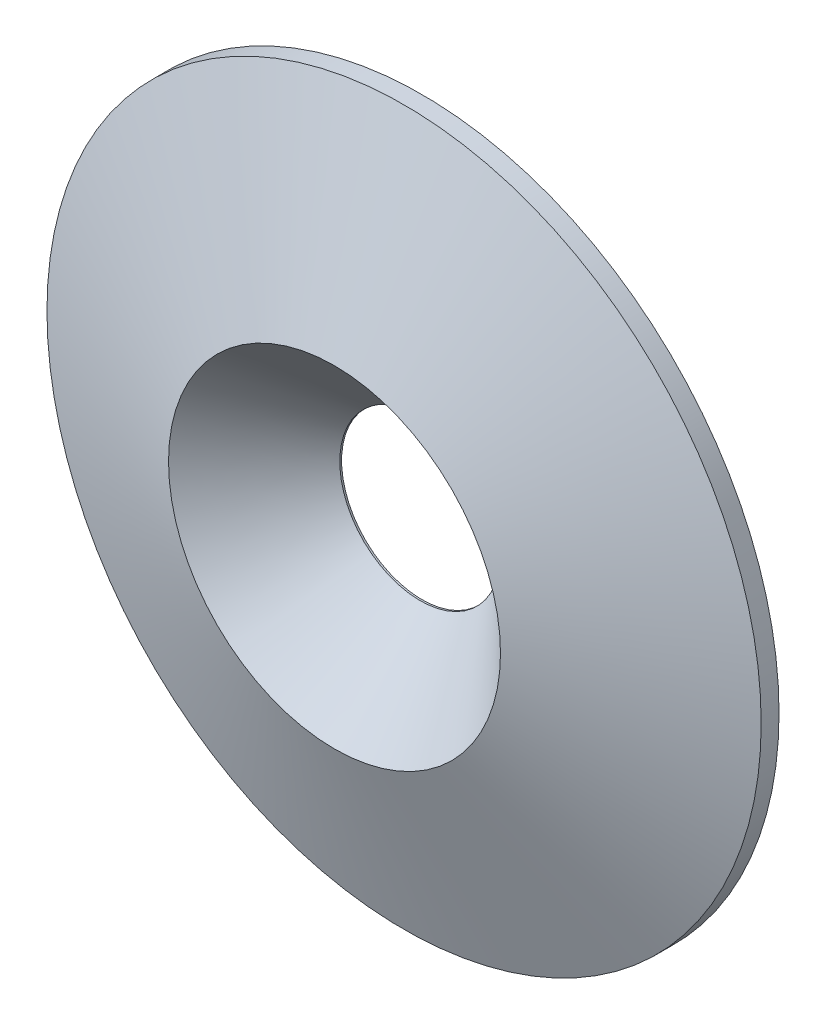
ISO-10303-21;
HEADER;
FILE_DESCRIPTION(('STEP AP214'),'2;1');
FILE_NAME('part.step','',(''),(''),'','','');
FILE_SCHEMA(('AUTOMOTIVE_DESIGN { 1 0 10303 214 1 1 1 1 }'));
ENDSEC;
DATA;
#1=APPLICATION_CONTEXT('core data for automotive mechanical design processes');
#2=APPLICATION_PROTOCOL_DEFINITION('international standard','automotive_design',2000,#1);
#3=PRODUCT_CONTEXT('',#1,'mechanical');
#4=PRODUCT('Part','Part','',(#3));
#5=PRODUCT_RELATED_PRODUCT_CATEGORY('part','',(#4));
#6=PRODUCT_DEFINITION_FORMATION('','',#4);
#7=PRODUCT_DEFINITION_CONTEXT('part definition',#1,'design');
#8=PRODUCT_DEFINITION('design','',#6,#7);
#9=PRODUCT_DEFINITION_SHAPE('','',#8);
#10=(LENGTH_UNIT() NAMED_UNIT(*) SI_UNIT(.MILLI.,.METRE.));
#11=(NAMED_UNIT(*) PLANE_ANGLE_UNIT() SI_UNIT($,.RADIAN.));
#12=(NAMED_UNIT(*) SI_UNIT($,.STERADIAN.) SOLID_ANGLE_UNIT());
#13=UNCERTAINTY_MEASURE_WITH_UNIT(LENGTH_MEASURE(1.E-05),#10,'distance_accuracy_value','');
#14=(GEOMETRIC_REPRESENTATION_CONTEXT(3) GLOBAL_UNCERTAINTY_ASSIGNED_CONTEXT((#13)) GLOBAL_UNIT_ASSIGNED_CONTEXT((#10,
#11,#12)) REPRESENTATION_CONTEXT('',''));
#15=CARTESIAN_POINT('',(0.,0.,0.));
#16=DIRECTION('',(0.,0.,1.));
#17=DIRECTION('',(1.,0.,0.));
#18=AXIS2_PLACEMENT_3D('',#15,#16,#17);
#19=CARTESIAN_POINT('',(0.,0.,2.5));
#20=DIRECTION('',(0.,0.,-1.));
#21=DIRECTION('',(-1.,0.,0.));
#22=AXIS2_PLACEMENT_3D('',#19,#20,#21);
#23=CYLINDRICAL_SURFACE('',#22,10.);
#24=CARTESIAN_POINT('',(0.,0.,0.499999999999961));
#25=DIRECTION('',(0.,0.,1.));
#26=DIRECTION('',(1.,0.,0.));
#27=AXIS2_PLACEMENT_3D('',#24,#25,#26);
#28=CIRCLE('',#27,10.);
#29=CARTESIAN_POINT('',(10.,0.,0.499999999999961));
#30=VERTEX_POINT('',#29);
#31=EDGE_CURVE('E10',#30,#30,#28,.F.);
#32=ORIENTED_EDGE('',*,*,#31,.T.);
#33=EDGE_LOOP('',(#32));
#34=FACE_BOUND('',#33,.T.);
#35=CARTESIAN_POINT('',(0.,0.,0.));
#36=DIRECTION('',(0.,0.,1.));
#37=DIRECTION('',(1.,0.,0.));
#38=AXIS2_PLACEMENT_3D('',#35,#36,#37);
#39=CIRCLE('',#38,10.);
#40=CARTESIAN_POINT('',(10.,0.,0.));
#41=VERTEX_POINT('',#40);
#42=EDGE_CURVE('E45',#41,#41,#39,.T.);
#43=ORIENTED_EDGE('',*,*,#42,.T.);
#44=EDGE_LOOP('',(#43));
#45=FACE_BOUND('',#44,.T.);
#46=ADVANCED_FACE('F34',(#34,#45),#23,.T.);
#47=CARTESIAN_POINT('',(0.,0.,0.));
#48=DIRECTION('',(0.,0.,1.));
#49=DIRECTION('',(1.,0.,0.));
#50=AXIS2_PLACEMENT_3D('',#47,#48,#49);
#51=PLANE('',#50);
#52=CARTESIAN_POINT('',(0.,0.,0.));
#53=DIRECTION('',(0.,0.,1.));
#54=DIRECTION('',(1.,0.,0.));
#55=AXIS2_PLACEMENT_3D('',#52,#53,#54);
#56=CIRCLE('',#55,2.25);
#57=CARTESIAN_POINT('',(2.25,0.,0.));
#58=VERTEX_POINT('',#57);
#59=EDGE_CURVE('E49',#58,#58,#56,.T.);
#60=ORIENTED_EDGE('',*,*,#59,.T.);
#61=EDGE_LOOP('',(#60));
#62=FACE_BOUND('',#61,.T.);
#63=ORIENTED_EDGE('',*,*,#42,.F.);
#64=EDGE_LOOP('',(#63));
#65=FACE_BOUND('',#64,.T.);
#66=ADVANCED_FACE('F68',(#62,#65),#51,.F.);
#67=CARTESIAN_POINT('',(0.,0.,2.5));
#68=DIRECTION('',(0.,0.,1.));
#69=DIRECTION('',(1.,0.,0.));
#70=AXIS2_PLACEMENT_3D('',#67,#68,#69);
#71=CYLINDRICAL_SURFACE('',#70,2.25);
#72=ORIENTED_EDGE('',*,*,#59,.F.);
#73=EDGE_LOOP('',(#72));
#74=FACE_BOUND('',#73,.T.);
#75=CARTESIAN_POINT('',(0.,0.,0.0499999999999984));
#76=DIRECTION('',(0.,0.,1.));
#77=DIRECTION('',(1.,0.,0.));
#78=AXIS2_PLACEMENT_3D('',#75,#76,#77);
#79=CIRCLE('',#78,2.25);
#80=CARTESIAN_POINT('',(2.25,0.,0.0499999999999984));
#81=VERTEX_POINT('',#80);
#82=EDGE_CURVE('E54',#81,#81,#79,.T.);
#83=ORIENTED_EDGE('',*,*,#82,.T.);
#84=EDGE_LOOP('',(#83));
#85=FACE_BOUND('',#84,.T.);
#86=ADVANCED_FACE('F58',(#74,#85),#71,.F.);
#87=CARTESIAN_POINT('',(0.,0.,2.5));
#88=DIRECTION('',(0.,0.,1.));
#89=DIRECTION('',(1.,0.,0.));
#90=AXIS2_PLACEMENT_3D('',#87,#88,#89);
#91=CONICAL_SURFACE('',#90,4.7,0.785398163397448);
#92=CARTESIAN_POINT('',(0.,0.,2.44797704773421));
#93=DIRECTION('',(0.,0.,1.));
#94=DIRECTION('',(1.,0.,0.));
#95=AXIS2_PLACEMENT_3D('',#92,#93,#94);
#96=CIRCLE('',#95,4.64797704773421);
#97=CARTESIAN_POINT('',(4.64797704773421,0.,2.44797704773421));
#98=VERTEX_POINT('',#97);
#99=EDGE_CURVE('E41',#98,#98,#96,.T.);
#100=ORIENTED_EDGE('',*,*,#99,.T.);
#101=EDGE_LOOP('',(#100));
#102=FACE_BOUND('',#101,.T.);
#103=ORIENTED_EDGE('',*,*,#82,.F.);
#104=EDGE_LOOP('',(#103));
#105=FACE_BOUND('',#104,.T.);
#106=ADVANCED_FACE('F60',(#102,#105),#91,.F.);
#107=CARTESIAN_POINT('',(0.,0.,2.5));
#108=DIRECTION('',(0.,0.,-1.));
#109=DIRECTION('',(-1.,0.,0.));
#110=AXIS2_PLACEMENT_3D('',#107,#108,#109);
#111=CONICAL_SURFACE('',#110,4.50504516109058,1.22173047639603);
#112=ORIENTED_EDGE('',*,*,#31,.F.);
#113=EDGE_LOOP('',(#112));
#114=FACE_BOUND('',#113,.T.);
#115=ORIENTED_EDGE('',*,*,#99,.F.);
#116=EDGE_LOOP('',(#115));
#117=FACE_BOUND('',#116,.T.);
#118=ADVANCED_FACE('F36',(#114,#117),#111,.T.);
#119=CLOSED_SHELL('',(#46,#66,#86,#106,#118));
#120=MANIFOLD_SOLID_BREP('B2',#119);
#121=ADVANCED_BREP_SHAPE_REPRESENTATION('',(#18,#120),#14);
#122=SHAPE_DEFINITION_REPRESENTATION(#9,#121);
ENDSEC;
END-ISO-10303-21;
